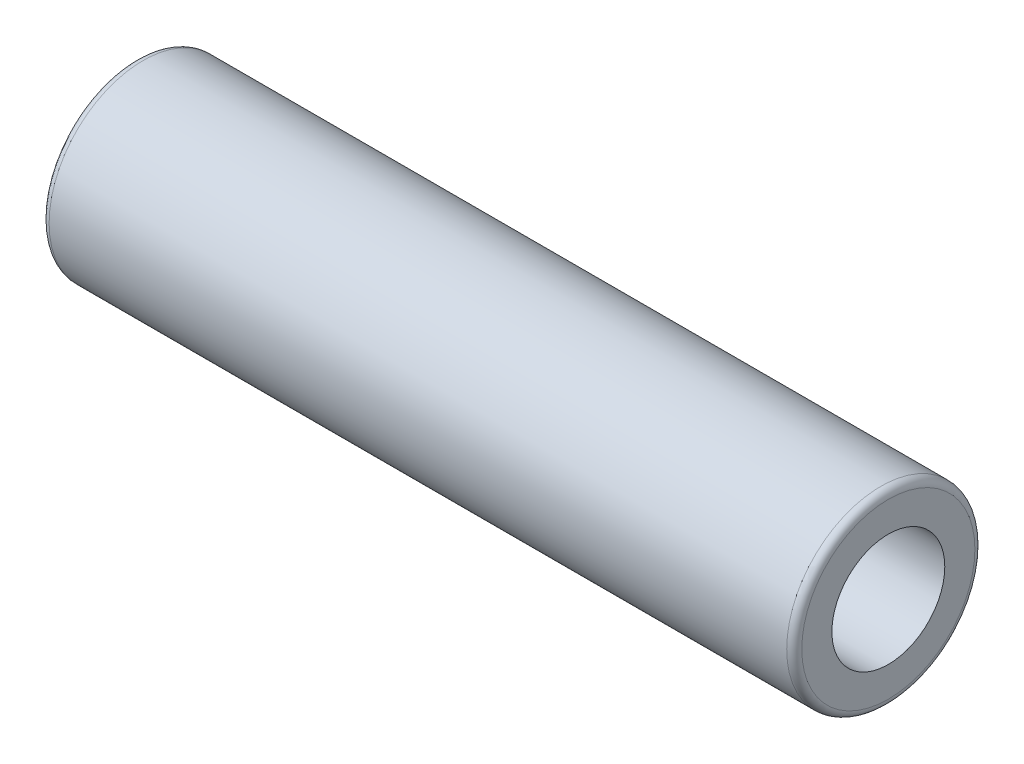
ISO-10303-21;
HEADER;
FILE_DESCRIPTION(('STEP AP214'),'2;1');
FILE_NAME('part.step','',(''),(''),'','','');
FILE_SCHEMA(('AUTOMOTIVE_DESIGN { 1 0 10303 214 1 1 1 1 }'));
ENDSEC;
DATA;
#1=APPLICATION_CONTEXT('core data for automotive mechanical design processes');
#2=APPLICATION_PROTOCOL_DEFINITION('international standard','automotive_design',2000,#1);
#3=PRODUCT_CONTEXT('',#1,'mechanical');
#4=PRODUCT('Part','Part','',(#3));
#5=PRODUCT_RELATED_PRODUCT_CATEGORY('part','',(#4));
#6=PRODUCT_DEFINITION_FORMATION('','',#4);
#7=PRODUCT_DEFINITION_CONTEXT('part definition',#1,'design');
#8=PRODUCT_DEFINITION('design','',#6,#7);
#9=PRODUCT_DEFINITION_SHAPE('','',#8);
#10=(LENGTH_UNIT() NAMED_UNIT(*) SI_UNIT(.MILLI.,.METRE.));
#11=(NAMED_UNIT(*) PLANE_ANGLE_UNIT() SI_UNIT($,.RADIAN.));
#12=(NAMED_UNIT(*) SI_UNIT($,.STERADIAN.) SOLID_ANGLE_UNIT());
#13=UNCERTAINTY_MEASURE_WITH_UNIT(LENGTH_MEASURE(1.E-05),#10,'distance_accuracy_value','');
#14=(GEOMETRIC_REPRESENTATION_CONTEXT(3) GLOBAL_UNCERTAINTY_ASSIGNED_CONTEXT((#13)) GLOBAL_UNIT_ASSIGNED_CONTEXT((#10,
#11,#12)) REPRESENTATION_CONTEXT('',''));
#15=CARTESIAN_POINT('',(0.,0.,0.));
#16=DIRECTION('',(0.,0.,1.));
#17=DIRECTION('',(1.,0.,0.));
#18=AXIS2_PLACEMENT_3D('',#15,#16,#17);
#19=CARTESIAN_POINT('',(49.5,0.,0.));
#20=DIRECTION('',(1.,0.,0.));
#21=DIRECTION('',(0.,0.,-1.));
#22=AXIS2_PLACEMENT_3D('',#19,#20,#21);
#23=TOROIDAL_SURFACE('',#22,5.74999999999965,0.5);
#24=CARTESIAN_POINT('',(50.,0.,0.));
#25=DIRECTION('',(1.,0.,0.));
#26=DIRECTION('',(0.,0.,-1.));
#27=AXIS2_PLACEMENT_3D('',#24,#25,#26);
#28=CIRCLE('',#27,5.74999999999965);
#29=CARTESIAN_POINT('',(50.,0.,-5.74999999999965));
#30=VERTEX_POINT('',#29);
#31=EDGE_CURVE('E46',#30,#30,#28,.T.);
#32=ORIENTED_EDGE('',*,*,#31,.F.);
#33=EDGE_LOOP('',(#32));
#34=FACE_BOUND('',#33,.T.);
#35=CARTESIAN_POINT('',(49.5,0.,0.));
#36=DIRECTION('',(1.,0.,0.));
#37=DIRECTION('',(0.,0.,-1.));
#38=AXIS2_PLACEMENT_3D('',#35,#36,#37);
#39=CIRCLE('',#38,6.24999999999965);
#40=CARTESIAN_POINT('',(49.5,0.,-6.24999999999965));
#41=VERTEX_POINT('',#40);
#42=EDGE_CURVE('E10',#41,#41,#39,.F.);
#43=ORIENTED_EDGE('',*,*,#42,.F.);
#44=EDGE_LOOP('',(#43));
#45=FACE_BOUND('',#44,.T.);
#46=ADVANCED_FACE('F39',(#34,#45),#23,.T.);
#47=CARTESIAN_POINT('',(0.5,0.,0.));
#48=DIRECTION('',(1.,0.,0.));
#49=DIRECTION('',(0.,0.,-1.));
#50=AXIS2_PLACEMENT_3D('',#47,#48,#49);
#51=TOROIDAL_SURFACE('',#50,5.74999999999965,0.5);
#52=CARTESIAN_POINT('',(0.,0.,0.));
#53=DIRECTION('',(1.,0.,0.));
#54=DIRECTION('',(0.,0.,-1.));
#55=AXIS2_PLACEMENT_3D('',#52,#53,#54);
#56=CIRCLE('',#55,5.74999999999965);
#57=CARTESIAN_POINT('',(0.,0.,-5.74999999999965));
#58=VERTEX_POINT('',#57);
#59=EDGE_CURVE('E56',#58,#58,#56,.F.);
#60=ORIENTED_EDGE('',*,*,#59,.F.);
#61=EDGE_LOOP('',(#60));
#62=FACE_BOUND('',#61,.T.);
#63=CARTESIAN_POINT('',(0.5,0.,0.));
#64=DIRECTION('',(1.,0.,0.));
#65=DIRECTION('',(0.,0.,-1.));
#66=AXIS2_PLACEMENT_3D('',#63,#64,#65);
#67=CIRCLE('',#66,6.24999999999965);
#68=CARTESIAN_POINT('',(0.5,0.,-6.24999999999965));
#69=VERTEX_POINT('',#68);
#70=EDGE_CURVE('E51',#69,#69,#67,.T.);
#71=ORIENTED_EDGE('',*,*,#70,.F.);
#72=EDGE_LOOP('',(#71));
#73=FACE_BOUND('',#72,.T.);
#74=ADVANCED_FACE('F87',(#62,#73),#51,.T.);
#75=CARTESIAN_POINT('',(50.,0.,0.));
#76=DIRECTION('',(-1.,0.,0.));
#77=DIRECTION('',(0.,0.,1.));
#78=AXIS2_PLACEMENT_3D('',#75,#76,#77);
#79=CYLINDRICAL_SURFACE('',#78,3.75000000000014);
#80=CARTESIAN_POINT('',(50.,0.,0.));
#81=DIRECTION('',(1.,0.,0.));
#82=DIRECTION('',(0.,0.,-1.));
#83=AXIS2_PLACEMENT_3D('',#80,#81,#82);
#84=CIRCLE('',#83,3.75000000000014);
#85=CARTESIAN_POINT('',(50.,0.,-3.75000000000014));
#86=VERTEX_POINT('',#85);
#87=EDGE_CURVE('E62',#86,#86,#84,.T.);
#88=ORIENTED_EDGE('',*,*,#87,.T.);
#89=EDGE_LOOP('',(#88));
#90=FACE_BOUND('',#89,.T.);
#91=CARTESIAN_POINT('',(0.,0.,0.));
#92=DIRECTION('',(1.,0.,0.));
#93=DIRECTION('',(0.,0.,-1.));
#94=AXIS2_PLACEMENT_3D('',#91,#92,#93);
#95=CIRCLE('',#94,3.75000000000014);
#96=CARTESIAN_POINT('',(0.,0.,-3.75000000000014));
#97=VERTEX_POINT('',#96);
#98=EDGE_CURVE('E63',#97,#97,#95,.T.);
#99=ORIENTED_EDGE('',*,*,#98,.F.);
#100=EDGE_LOOP('',(#99));
#101=FACE_BOUND('',#100,.T.);
#102=ADVANCED_FACE('F71',(#90,#101),#79,.F.);
#103=CARTESIAN_POINT('',(50.,0.,0.));
#104=DIRECTION('',(-1.,0.,0.));
#105=DIRECTION('',(0.,0.,1.));
#106=AXIS2_PLACEMENT_3D('',#103,#104,#105);
#107=CYLINDRICAL_SURFACE('',#106,6.24999999999965);
#108=ORIENTED_EDGE('',*,*,#42,.T.);
#109=EDGE_LOOP('',(#108));
#110=FACE_BOUND('',#109,.T.);
#111=ORIENTED_EDGE('',*,*,#70,.T.);
#112=EDGE_LOOP('',(#111));
#113=FACE_BOUND('',#112,.T.);
#114=ADVANCED_FACE('F77',(#110,#113),#107,.T.);
#115=CARTESIAN_POINT('',(50.,0.,0.));
#116=DIRECTION('',(1.,0.,0.));
#117=DIRECTION('',(0.,0.,-1.));
#118=AXIS2_PLACEMENT_3D('',#115,#116,#117);
#119=PLANE('',#118);
#120=ORIENTED_EDGE('',*,*,#31,.T.);
#121=EDGE_LOOP('',(#120));
#122=FACE_BOUND('',#121,.T.);
#123=ORIENTED_EDGE('',*,*,#87,.F.);
#124=EDGE_LOOP('',(#123));
#125=FACE_BOUND('',#124,.T.);
#126=ADVANCED_FACE('F74',(#122,#125),#119,.T.);
#127=CARTESIAN_POINT('',(0.,0.,0.));
#128=DIRECTION('',(1.,0.,0.));
#129=DIRECTION('',(0.,0.,-1.));
#130=AXIS2_PLACEMENT_3D('',#127,#128,#129);
#131=PLANE('',#130);
#132=ORIENTED_EDGE('',*,*,#59,.T.);
#133=EDGE_LOOP('',(#132));
#134=FACE_BOUND('',#133,.T.);
#135=ORIENTED_EDGE('',*,*,#98,.T.);
#136=EDGE_LOOP('',(#135));
#137=FACE_BOUND('',#136,.T.);
#138=ADVANCED_FACE('F76',(#134,#137),#131,.F.);
#139=CLOSED_SHELL('',(#46,#74,#102,#114,#126,#138));
#140=MANIFOLD_SOLID_BREP('B2',#139);
#141=ADVANCED_BREP_SHAPE_REPRESENTATION('',(#18,#140),#14);
#142=SHAPE_DEFINITION_REPRESENTATION(#9,#141);
ENDSEC;
END-ISO-10303-21;
